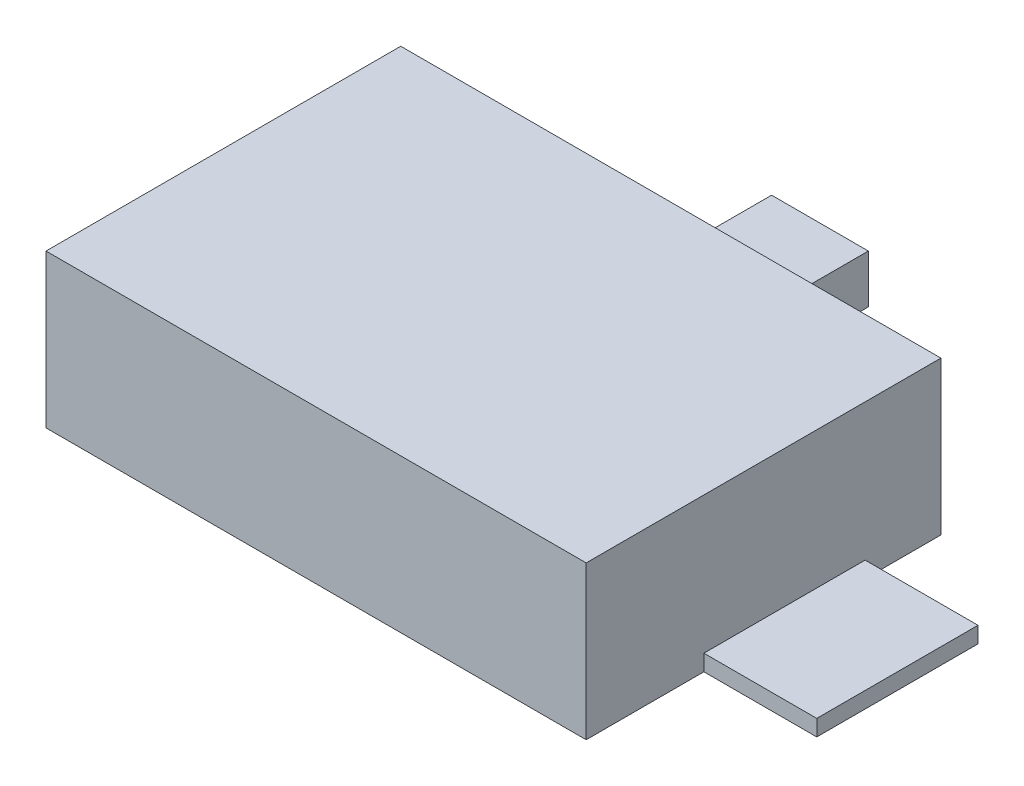
ISO-10303-21;
HEADER;
FILE_DESCRIPTION(('STEP AP214'),'2;1');
FILE_NAME('part.step','',(''),(''),'','','');
FILE_SCHEMA(('AUTOMOTIVE_DESIGN { 1 0 10303 214 1 1 1 1 }'));
ENDSEC;
DATA;
#1=APPLICATION_CONTEXT('core data for automotive mechanical design processes');
#2=APPLICATION_PROTOCOL_DEFINITION('international standard','automotive_design',2000,#1);
#3=PRODUCT_CONTEXT('',#1,'mechanical');
#4=PRODUCT('Part','Part','',(#3));
#5=PRODUCT_RELATED_PRODUCT_CATEGORY('part','',(#4));
#6=PRODUCT_DEFINITION_FORMATION('','',#4);
#7=PRODUCT_DEFINITION_CONTEXT('part definition',#1,'design');
#8=PRODUCT_DEFINITION('design','',#6,#7);
#9=PRODUCT_DEFINITION_SHAPE('','',#8);
#10=(LENGTH_UNIT() NAMED_UNIT(*) SI_UNIT(.MILLI.,.METRE.));
#11=(NAMED_UNIT(*) PLANE_ANGLE_UNIT() SI_UNIT($,.RADIAN.));
#12=(NAMED_UNIT(*) SI_UNIT($,.STERADIAN.) SOLID_ANGLE_UNIT());
#13=UNCERTAINTY_MEASURE_WITH_UNIT(LENGTH_MEASURE(1.E-05),#10,'distance_accuracy_value','');
#14=(GEOMETRIC_REPRESENTATION_CONTEXT(3) GLOBAL_UNCERTAINTY_ASSIGNED_CONTEXT((#13)) GLOBAL_UNIT_ASSIGNED_CONTEXT((#10,
#11,#12)) REPRESENTATION_CONTEXT('',''));
#15=CARTESIAN_POINT('',(0.,0.,0.));
#16=DIRECTION('',(0.,0.,1.));
#17=DIRECTION('',(1.,0.,0.));
#18=AXIS2_PLACEMENT_3D('',#15,#16,#17);
#19=CARTESIAN_POINT('',(-42.545,24.13,-27.94));
#20=DIRECTION('',(0.,0.,1.));
#21=DIRECTION('',(1.,0.,0.));
#22=AXIS2_PLACEMENT_3D('',#19,#20,#21);
#23=PLANE('',#22);
#24=DIRECTION('',(0.,1.,0.));
#25=VECTOR('',#24,1.);
#26=CARTESIAN_POINT('',(-9.52499999999999,7.62,-27.94));
#27=LINE('',#26,#25);
#28=CARTESIAN_POINT('',(-9.52499999999998,0.,-27.94));
#29=VERTEX_POINT('',#28);
#30=CARTESIAN_POINT('',(-9.52499999999999,7.62,-27.94));
#31=VERTEX_POINT('',#30);
#32=EDGE_CURVE('E55',#29,#31,#27,.T.);
#33=ORIENTED_EDGE('',*,*,#32,.F.);
#34=DIRECTION('',(-1.,0.,0.));
#35=VECTOR('',#34,1.);
#36=CARTESIAN_POINT('',(-42.545,0.,-27.94));
#37=LINE('',#36,#35);
#38=CARTESIAN_POINT('',(-42.545,0.,-27.94));
#39=VERTEX_POINT('',#38);
#40=EDGE_CURVE('E192',#29,#39,#37,.T.);
#41=ORIENTED_EDGE('',*,*,#40,.T.);
#42=DIRECTION('',(0.,-1.,0.));
#43=VECTOR('',#42,1.);
#44=CARTESIAN_POINT('',(-42.545,24.13,-27.94));
#45=LINE('',#44,#43);
#46=CARTESIAN_POINT('',(-42.545,24.13,-27.94));
#47=VERTEX_POINT('',#46);
#48=EDGE_CURVE('E199',#47,#39,#45,.T.);
#49=ORIENTED_EDGE('',*,*,#48,.F.);
#50=DIRECTION('',(-1.,0.,0.));
#51=VECTOR('',#50,1.);
#52=CARTESIAN_POINT('',(-42.545,24.13,-27.94));
#53=LINE('',#52,#51);
#54=CARTESIAN_POINT('',(42.545,24.13,-27.94));
#55=VERTEX_POINT('',#54);
#56=EDGE_CURVE('E204',#55,#47,#53,.T.);
#57=ORIENTED_EDGE('',*,*,#56,.F.);
#58=DIRECTION('',(0.,-1.,0.));
#59=VECTOR('',#58,1.);
#60=CARTESIAN_POINT('',(42.545,24.13,-27.94));
#61=LINE('',#60,#59);
#62=CARTESIAN_POINT('',(42.545,0.,-27.94));
#63=VERTEX_POINT('',#62);
#64=EDGE_CURVE('E203',#55,#63,#61,.T.);
#65=ORIENTED_EDGE('',*,*,#64,.T.);
#66=CARTESIAN_POINT('',(5.71500000000001,0.,-27.94));
#67=VERTEX_POINT('',#66);
#68=EDGE_CURVE('E188',#63,#67,#37,.T.);
#69=ORIENTED_EDGE('',*,*,#68,.T.);
#70=DIRECTION('',(0.,-1.,0.));
#71=VECTOR('',#70,1.);
#72=CARTESIAN_POINT('',(5.71500000000001,7.62,-27.94));
#73=LINE('',#72,#71);
#74=CARTESIAN_POINT('',(5.71500000000001,7.62,-27.94));
#75=VERTEX_POINT('',#74);
#76=EDGE_CURVE('E141',#75,#67,#73,.T.);
#77=ORIENTED_EDGE('',*,*,#76,.F.);
#78=DIRECTION('',(1.,0.,0.));
#79=VECTOR('',#78,1.);
#80=CARTESIAN_POINT('',(-9.52499999999999,7.62,-27.94));
#81=LINE('',#80,#79);
#82=EDGE_CURVE('E50',#31,#75,#81,.T.);
#83=ORIENTED_EDGE('',*,*,#82,.F.);
#84=EDGE_LOOP('',(#33,#41,#49,#57,#65,#69,#77,#83));
#85=FACE_BOUND('',#84,.T.);
#86=ADVANCED_FACE('F33',(#85),#23,.F.);
#87=CARTESIAN_POINT('',(42.545,24.13,-27.94));
#88=DIRECTION('',(-1.,0.,0.));
#89=DIRECTION('',(0.,0.,1.));
#90=AXIS2_PLACEMENT_3D('',#87,#88,#89);
#91=PLANE('',#90);
#92=DIRECTION('',(0.,-1.,0.));
#93=VECTOR('',#92,1.);
#94=CARTESIAN_POINT('',(42.545,2.54,9.398));
#95=LINE('',#94,#93);
#96=CARTESIAN_POINT('',(42.545,2.54,9.398));
#97=VERTEX_POINT('',#96);
#98=CARTESIAN_POINT('',(42.545,0.,9.398));
#99=VERTEX_POINT('',#98);
#100=EDGE_CURVE('E178',#97,#99,#95,.T.);
#101=ORIENTED_EDGE('',*,*,#100,.F.);
#102=DIRECTION('',(0.,0.,-1.));
#103=VECTOR('',#102,1.);
#104=CARTESIAN_POINT('',(42.545,2.54,9.398));
#105=LINE('',#104,#103);
#106=CARTESIAN_POINT('',(42.545,2.54,-16.002));
#107=VERTEX_POINT('',#106);
#108=EDGE_CURVE('E160',#97,#107,#105,.T.);
#109=ORIENTED_EDGE('',*,*,#108,.T.);
#110=DIRECTION('',(0.,-1.,0.));
#111=VECTOR('',#110,1.);
#112=CARTESIAN_POINT('',(42.545,2.54,-16.002));
#113=LINE('',#112,#111);
#114=CARTESIAN_POINT('',(42.545,0.,-16.002));
#115=VERTEX_POINT('',#114);
#116=EDGE_CURVE('E170',#107,#115,#113,.T.);
#117=ORIENTED_EDGE('',*,*,#116,.T.);
#118=DIRECTION('',(0.,0.,-1.));
#119=VECTOR('',#118,1.);
#120=CARTESIAN_POINT('',(42.545,0.,-27.94));
#121=LINE('',#120,#119);
#122=EDGE_CURVE('E212',#115,#63,#121,.T.);
#123=ORIENTED_EDGE('',*,*,#122,.T.);
#124=ORIENTED_EDGE('',*,*,#64,.F.);
#125=DIRECTION('',(0.,0.,-1.));
#126=VECTOR('',#125,1.);
#127=CARTESIAN_POINT('',(42.545,24.13,-27.94));
#128=LINE('',#127,#126);
#129=CARTESIAN_POINT('',(42.545,24.13,27.94));
#130=VERTEX_POINT('',#129);
#131=EDGE_CURVE('E268',#130,#55,#128,.T.);
#132=ORIENTED_EDGE('',*,*,#131,.F.);
#133=DIRECTION('',(0.,-1.,0.));
#134=VECTOR('',#133,1.);
#135=CARTESIAN_POINT('',(42.545,24.13,27.94));
#136=LINE('',#135,#134);
#137=CARTESIAN_POINT('',(42.545,0.,27.94));
#138=VERTEX_POINT('',#137);
#139=EDGE_CURVE('E42',#130,#138,#136,.T.);
#140=ORIENTED_EDGE('',*,*,#139,.T.);
#141=EDGE_CURVE('E209',#138,#99,#121,.T.);
#142=ORIENTED_EDGE('',*,*,#141,.T.);
#143=EDGE_LOOP('',(#101,#109,#117,#123,#124,#132,#140,#142));
#144=FACE_BOUND('',#143,.T.);
#145=ADVANCED_FACE('F226',(#144),#91,.F.);
#146=CARTESIAN_POINT('',(-42.545,24.13,-27.94));
#147=DIRECTION('',(1.,0.,0.));
#148=DIRECTION('',(0.,0.,-1.));
#149=AXIS2_PLACEMENT_3D('',#146,#147,#148);
#150=PLANE('',#149);
#151=DIRECTION('',(0.,0.,1.));
#152=VECTOR('',#151,1.);
#153=CARTESIAN_POINT('',(-42.545,0.,-27.94));
#154=LINE('',#153,#152);
#155=CARTESIAN_POINT('',(-42.545,0.,27.94));
#156=VERTEX_POINT('',#155);
#157=EDGE_CURVE('E169',#39,#156,#154,.T.);
#158=ORIENTED_EDGE('',*,*,#157,.T.);
#159=DIRECTION('',(0.,-1.,0.));
#160=VECTOR('',#159,1.);
#161=CARTESIAN_POINT('',(-42.545,24.13,27.94));
#162=LINE('',#161,#160);
#163=CARTESIAN_POINT('',(-42.545,24.13,27.94));
#164=VERTEX_POINT('',#163);
#165=EDGE_CURVE('E11',#164,#156,#162,.T.);
#166=ORIENTED_EDGE('',*,*,#165,.F.);
#167=DIRECTION('',(0.,0.,1.));
#168=VECTOR('',#167,1.);
#169=CARTESIAN_POINT('',(-42.545,24.13,-27.94));
#170=LINE('',#169,#168);
#171=EDGE_CURVE('E191',#47,#164,#170,.T.);
#172=ORIENTED_EDGE('',*,*,#171,.F.);
#173=ORIENTED_EDGE('',*,*,#48,.T.);
#174=EDGE_LOOP('',(#158,#166,#172,#173));
#175=FACE_BOUND('',#174,.T.);
#176=ADVANCED_FACE('F35',(#175),#150,.F.);
#177=CARTESIAN_POINT('',(-42.545,24.13,27.94));
#178=DIRECTION('',(0.,0.,-1.));
#179=DIRECTION('',(-1.,0.,0.));
#180=AXIS2_PLACEMENT_3D('',#177,#178,#179);
#181=PLANE('',#180);
#182=DIRECTION('',(1.,0.,0.));
#183=VECTOR('',#182,1.);
#184=CARTESIAN_POINT('',(-42.545,0.,27.94));
#185=LINE('',#184,#183);
#186=EDGE_CURVE('E213',#156,#138,#185,.T.);
#187=ORIENTED_EDGE('',*,*,#186,.T.);
#188=ORIENTED_EDGE('',*,*,#139,.F.);
#189=DIRECTION('',(1.,0.,0.));
#190=VECTOR('',#189,1.);
#191=CARTESIAN_POINT('',(-42.545,24.13,27.94));
#192=LINE('',#191,#190);
#193=EDGE_CURVE('E270',#164,#130,#192,.T.);
#194=ORIENTED_EDGE('',*,*,#193,.F.);
#195=ORIENTED_EDGE('',*,*,#165,.T.);
#196=EDGE_LOOP('',(#187,#188,#194,#195));
#197=FACE_BOUND('',#196,.T.);
#198=ADVANCED_FACE('F254',(#197),#181,.F.);
#199=CARTESIAN_POINT('',(0.,24.13,0.));
#200=DIRECTION('',(0.,1.,0.));
#201=DIRECTION('',(0.,0.,1.));
#202=AXIS2_PLACEMENT_3D('',#199,#200,#201);
#203=PLANE('',#202);
#204=ORIENTED_EDGE('',*,*,#171,.T.);
#205=ORIENTED_EDGE('',*,*,#193,.T.);
#206=ORIENTED_EDGE('',*,*,#131,.T.);
#207=ORIENTED_EDGE('',*,*,#56,.T.);
#208=EDGE_LOOP('',(#204,#205,#206,#207));
#209=FACE_BOUND('',#208,.T.);
#210=ADVANCED_FACE('F244',(#209),#203,.T.);
#211=CARTESIAN_POINT('',(0.,0.,0.));
#212=DIRECTION('',(0.,1.,0.));
#213=DIRECTION('',(0.,0.,1.));
#214=AXIS2_PLACEMENT_3D('',#211,#212,#213);
#215=PLANE('',#214);
#216=ORIENTED_EDGE('',*,*,#157,.F.);
#217=ORIENTED_EDGE('',*,*,#40,.F.);
#218=DIRECTION('',(0.,0.,1.));
#219=VECTOR('',#218,1.);
#220=CARTESIAN_POINT('',(-9.52499999999999,0.,-53.34));
#221=LINE('',#220,#219);
#222=CARTESIAN_POINT('',(-9.52499999999999,0.,-53.34));
#223=VERTEX_POINT('',#222);
#224=EDGE_CURVE('E277',#223,#29,#221,.T.);
#225=ORIENTED_EDGE('',*,*,#224,.F.);
#226=DIRECTION('',(-1.,0.,0.));
#227=VECTOR('',#226,1.);
#228=CARTESIAN_POINT('',(-9.52499999999999,0.,-53.34));
#229=LINE('',#228,#227);
#230=CARTESIAN_POINT('',(5.71500000000001,0.,-53.34));
#231=VERTEX_POINT('',#230);
#232=EDGE_CURVE('E137',#231,#223,#229,.T.);
#233=ORIENTED_EDGE('',*,*,#232,.F.);
#234=DIRECTION('',(0.,0.,1.));
#235=VECTOR('',#234,1.);
#236=CARTESIAN_POINT('',(5.71500000000001,0.,-53.34));
#237=LINE('',#236,#235);
#238=EDGE_CURVE('E149',#231,#67,#237,.T.);
#239=ORIENTED_EDGE('',*,*,#238,.T.);
#240=ORIENTED_EDGE('',*,*,#68,.F.);
#241=ORIENTED_EDGE('',*,*,#122,.F.);
#242=DIRECTION('',(1.,0.,0.));
#243=VECTOR('',#242,1.);
#244=CARTESIAN_POINT('',(60.325,0.,-16.002));
#245=LINE('',#244,#243);
#246=CARTESIAN_POINT('',(60.325,0.,-16.002));
#247=VERTEX_POINT('',#246);
#248=EDGE_CURVE('E157',#115,#247,#245,.T.);
#249=ORIENTED_EDGE('',*,*,#248,.T.);
#250=DIRECTION('',(0.,0.,1.));
#251=VECTOR('',#250,1.);
#252=CARTESIAN_POINT('',(60.325,0.,9.398));
#253=LINE('',#252,#251);
#254=CARTESIAN_POINT('',(60.325,0.,9.398));
#255=VERTEX_POINT('',#254);
#256=EDGE_CURVE('E144',#247,#255,#253,.T.);
#257=ORIENTED_EDGE('',*,*,#256,.T.);
#258=DIRECTION('',(-1.,0.,0.));
#259=VECTOR('',#258,1.);
#260=CARTESIAN_POINT('',(60.325,0.,9.398));
#261=LINE('',#260,#259);
#262=EDGE_CURVE('E147',#255,#99,#261,.T.);
#263=ORIENTED_EDGE('',*,*,#262,.T.);
#264=ORIENTED_EDGE('',*,*,#141,.F.);
#265=ORIENTED_EDGE('',*,*,#186,.F.);
#266=EDGE_LOOP('',(#216,#217,#225,#233,#239,#240,#241,#249,#257,#263,#264,#265));
#267=FACE_BOUND('',#266,.T.);
#268=ADVANCED_FACE('F218',(#267),#215,.F.);
#269=CARTESIAN_POINT('',(60.325,2.54,9.398));
#270=DIRECTION('',(1.,0.,0.));
#271=DIRECTION('',(0.,0.,-1.));
#272=AXIS2_PLACEMENT_3D('',#269,#270,#271);
#273=PLANE('',#272);
#274=ORIENTED_EDGE('',*,*,#256,.F.);
#275=DIRECTION('',(0.,-1.,0.));
#276=VECTOR('',#275,1.);
#277=CARTESIAN_POINT('',(60.325,2.54,-16.002));
#278=LINE('',#277,#276);
#279=CARTESIAN_POINT('',(60.325,2.54,-16.002));
#280=VERTEX_POINT('',#279);
#281=EDGE_CURVE('E167',#280,#247,#278,.T.);
#282=ORIENTED_EDGE('',*,*,#281,.F.);
#283=DIRECTION('',(0.,0.,1.));
#284=VECTOR('',#283,1.);
#285=CARTESIAN_POINT('',(60.325,2.54,9.398));
#286=LINE('',#285,#284);
#287=CARTESIAN_POINT('',(60.325,2.54,9.398));
#288=VERTEX_POINT('',#287);
#289=EDGE_CURVE('E153',#280,#288,#286,.T.);
#290=ORIENTED_EDGE('',*,*,#289,.T.);
#291=DIRECTION('',(0.,-1.,0.));
#292=VECTOR('',#291,1.);
#293=CARTESIAN_POINT('',(60.325,2.54,9.398));
#294=LINE('',#293,#292);
#295=EDGE_CURVE('E165',#288,#255,#294,.T.);
#296=ORIENTED_EDGE('',*,*,#295,.T.);
#297=EDGE_LOOP('',(#274,#282,#290,#296));
#298=FACE_BOUND('',#297,.T.);
#299=ADVANCED_FACE('F236',(#298),#273,.T.);
#300=CARTESIAN_POINT('',(60.325,2.54,-16.002));
#301=DIRECTION('',(0.,0.,-1.));
#302=DIRECTION('',(-1.,0.,0.));
#303=AXIS2_PLACEMENT_3D('',#300,#301,#302);
#304=PLANE('',#303);
#305=ORIENTED_EDGE('',*,*,#248,.F.);
#306=ORIENTED_EDGE('',*,*,#116,.F.);
#307=DIRECTION('',(1.,0.,0.));
#308=VECTOR('',#307,1.);
#309=CARTESIAN_POINT('',(60.325,2.54,-16.002));
#310=LINE('',#309,#308);
#311=EDGE_CURVE('E163',#107,#280,#310,.T.);
#312=ORIENTED_EDGE('',*,*,#311,.T.);
#313=ORIENTED_EDGE('',*,*,#281,.T.);
#314=EDGE_LOOP('',(#305,#306,#312,#313));
#315=FACE_BOUND('',#314,.T.);
#316=ADVANCED_FACE('F222',(#315),#304,.T.);
#317=CARTESIAN_POINT('',(60.325,2.54,9.398));
#318=DIRECTION('',(0.,0.,1.));
#319=DIRECTION('',(1.,0.,0.));
#320=AXIS2_PLACEMENT_3D('',#317,#318,#319);
#321=PLANE('',#320);
#322=ORIENTED_EDGE('',*,*,#262,.F.);
#323=ORIENTED_EDGE('',*,*,#295,.F.);
#324=DIRECTION('',(-1.,0.,0.));
#325=VECTOR('',#324,1.);
#326=CARTESIAN_POINT('',(60.325,2.54,9.398));
#327=LINE('',#326,#325);
#328=EDGE_CURVE('E156',#288,#97,#327,.T.);
#329=ORIENTED_EDGE('',*,*,#328,.T.);
#330=ORIENTED_EDGE('',*,*,#100,.T.);
#331=EDGE_LOOP('',(#322,#323,#329,#330));
#332=FACE_BOUND('',#331,.T.);
#333=ADVANCED_FACE('F234',(#332),#321,.T.);
#334=CARTESIAN_POINT('',(0.,2.54,0.));
#335=DIRECTION('',(0.,1.,0.));
#336=DIRECTION('',(0.,0.,1.));
#337=AXIS2_PLACEMENT_3D('',#334,#335,#336);
#338=PLANE('',#337);
#339=ORIENTED_EDGE('',*,*,#289,.F.);
#340=ORIENTED_EDGE('',*,*,#311,.F.);
#341=ORIENTED_EDGE('',*,*,#108,.F.);
#342=ORIENTED_EDGE('',*,*,#328,.F.);
#343=EDGE_LOOP('',(#339,#340,#341,#342));
#344=FACE_BOUND('',#343,.T.);
#345=ADVANCED_FACE('F231',(#344),#338,.T.);
#346=CARTESIAN_POINT('',(-9.52499999999999,7.62,-53.34));
#347=DIRECTION('',(1.,0.,0.));
#348=DIRECTION('',(0.,1.,0.));
#349=AXIS2_PLACEMENT_3D('',#346,#347,#348);
#350=PLANE('',#349);
#351=ORIENTED_EDGE('',*,*,#32,.T.);
#352=DIRECTION('',(0.,0.,1.));
#353=VECTOR('',#352,1.);
#354=CARTESIAN_POINT('',(-9.52499999999999,7.62,-53.34));
#355=LINE('',#354,#353);
#356=CARTESIAN_POINT('',(-9.52499999999999,7.62,-53.34));
#357=VERTEX_POINT('',#356);
#358=EDGE_CURVE('E126',#357,#31,#355,.T.);
#359=ORIENTED_EDGE('',*,*,#358,.F.);
#360=DIRECTION('',(0.,1.,0.));
#361=VECTOR('',#360,1.);
#362=CARTESIAN_POINT('',(-9.52499999999999,7.62,-53.34));
#363=LINE('',#362,#361);
#364=EDGE_CURVE('E132',#223,#357,#363,.T.);
#365=ORIENTED_EDGE('',*,*,#364,.F.);
#366=ORIENTED_EDGE('',*,*,#224,.T.);
#367=EDGE_LOOP('',(#351,#359,#365,#366));
#368=FACE_BOUND('',#367,.T.);
#369=ADVANCED_FACE('F143',(#368),#350,.F.);
#370=CARTESIAN_POINT('',(-9.52499999999999,7.62,-53.34));
#371=DIRECTION('',(0.,-1.,0.));
#372=DIRECTION('',(1.,0.,0.));
#373=AXIS2_PLACEMENT_3D('',#370,#371,#372);
#374=PLANE('',#373);
#375=ORIENTED_EDGE('',*,*,#82,.T.);
#376=DIRECTION('',(0.,0.,1.));
#377=VECTOR('',#376,1.);
#378=CARTESIAN_POINT('',(5.71500000000001,7.62,-53.34));
#379=LINE('',#378,#377);
#380=CARTESIAN_POINT('',(5.71500000000001,7.62,-53.34));
#381=VERTEX_POINT('',#380);
#382=EDGE_CURVE('E128',#381,#75,#379,.T.);
#383=ORIENTED_EDGE('',*,*,#382,.F.);
#384=DIRECTION('',(1.,0.,0.));
#385=VECTOR('',#384,1.);
#386=CARTESIAN_POINT('',(-9.52499999999999,7.62,-53.34));
#387=LINE('',#386,#385);
#388=EDGE_CURVE('E122',#357,#381,#387,.T.);
#389=ORIENTED_EDGE('',*,*,#388,.F.);
#390=ORIENTED_EDGE('',*,*,#358,.T.);
#391=EDGE_LOOP('',(#375,#383,#389,#390));
#392=FACE_BOUND('',#391,.T.);
#393=ADVANCED_FACE('F124',(#392),#374,.F.);
#394=CARTESIAN_POINT('',(5.71500000000001,7.62,-53.34));
#395=DIRECTION('',(-1.,0.,0.));
#396=DIRECTION('',(0.,-1.,0.));
#397=AXIS2_PLACEMENT_3D('',#394,#395,#396);
#398=PLANE('',#397);
#399=ORIENTED_EDGE('',*,*,#76,.T.);
#400=ORIENTED_EDGE('',*,*,#238,.F.);
#401=DIRECTION('',(0.,-1.,0.));
#402=VECTOR('',#401,1.);
#403=CARTESIAN_POINT('',(5.71500000000001,7.62,-53.34));
#404=LINE('',#403,#402);
#405=EDGE_CURVE('E131',#381,#231,#404,.T.);
#406=ORIENTED_EDGE('',*,*,#405,.F.);
#407=ORIENTED_EDGE('',*,*,#382,.T.);
#408=EDGE_LOOP('',(#399,#400,#406,#407));
#409=FACE_BOUND('',#408,.T.);
#410=ADVANCED_FACE('F292',(#409),#398,.F.);
#411=CARTESIAN_POINT('',(0.,0.,-53.34));
#412=DIRECTION('',(0.,0.,1.));
#413=DIRECTION('',(1.,0.,0.));
#414=AXIS2_PLACEMENT_3D('',#411,#412,#413);
#415=PLANE('',#414);
#416=ORIENTED_EDGE('',*,*,#364,.T.);
#417=ORIENTED_EDGE('',*,*,#388,.T.);
#418=ORIENTED_EDGE('',*,*,#405,.T.);
#419=ORIENTED_EDGE('',*,*,#232,.T.);
#420=EDGE_LOOP('',(#416,#417,#418,#419));
#421=FACE_BOUND('',#420,.T.);
#422=ADVANCED_FACE('F135',(#421),#415,.F.);
#423=CLOSED_SHELL('',(#86,#145,#176,#198,#210,#268,#299,#316,#333,#345,#369,#393,#410,#422));
#424=MANIFOLD_SOLID_BREP('B2',#423);
#425=ADVANCED_BREP_SHAPE_REPRESENTATION('',(#18,#424),#14);
#426=SHAPE_DEFINITION_REPRESENTATION(#9,#425);
ENDSEC;
END-ISO-10303-21;
